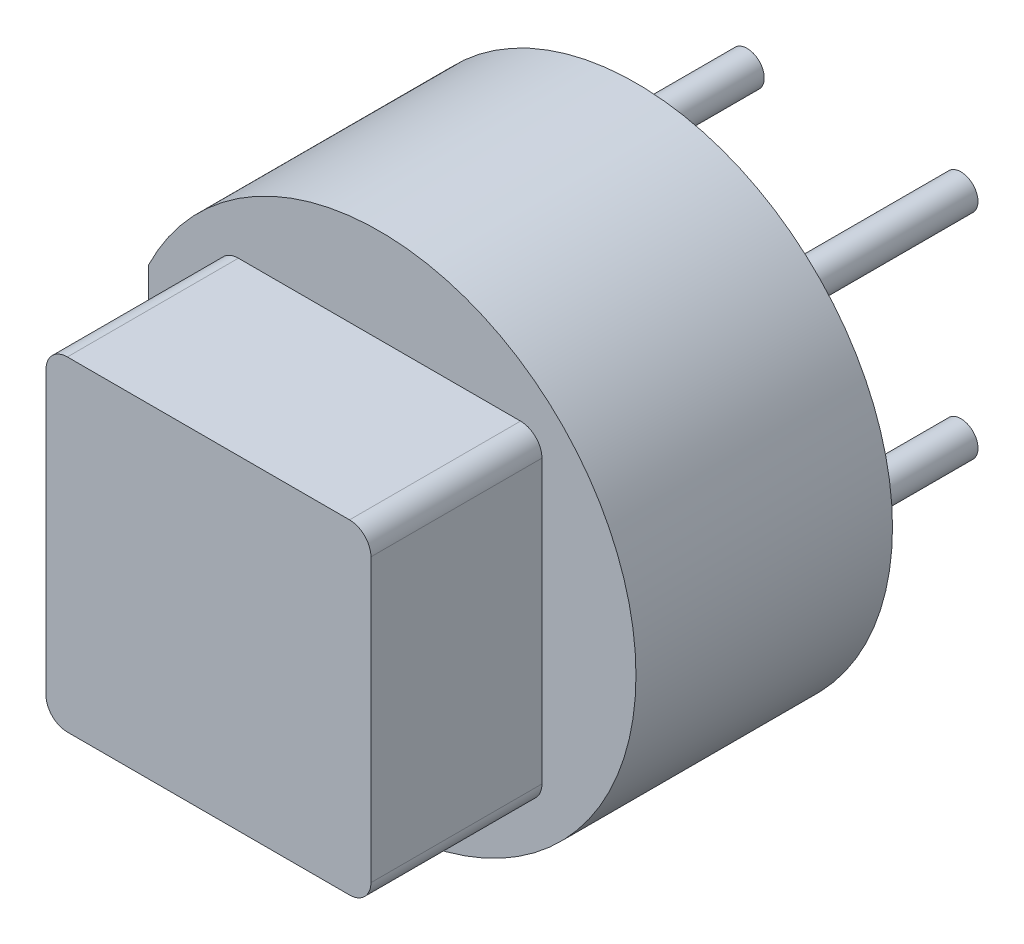
ISO-10303-21;
HEADER;
FILE_DESCRIPTION(('STEP AP214'),'2;1');
FILE_NAME('part.step','',(''),(''),'','','');
FILE_SCHEMA(('AUTOMOTIVE_DESIGN { 1 0 10303 214 1 1 1 1 }'));
ENDSEC;
DATA;
#1=APPLICATION_CONTEXT('core data for automotive mechanical design processes');
#2=APPLICATION_PROTOCOL_DEFINITION('international standard','automotive_design',2000,#1);
#3=PRODUCT_CONTEXT('',#1,'mechanical');
#4=PRODUCT('Part','Part','',(#3));
#5=PRODUCT_RELATED_PRODUCT_CATEGORY('part','',(#4));
#6=PRODUCT_DEFINITION_FORMATION('','',#4);
#7=PRODUCT_DEFINITION_CONTEXT('part definition',#1,'design');
#8=PRODUCT_DEFINITION('design','',#6,#7);
#9=PRODUCT_DEFINITION_SHAPE('','',#8);
#10=(LENGTH_UNIT() NAMED_UNIT(*) SI_UNIT(.MILLI.,.METRE.));
#11=(NAMED_UNIT(*) PLANE_ANGLE_UNIT() SI_UNIT($,.RADIAN.));
#12=(NAMED_UNIT(*) SI_UNIT($,.STERADIAN.) SOLID_ANGLE_UNIT());
#13=UNCERTAINTY_MEASURE_WITH_UNIT(LENGTH_MEASURE(1.E-05),#10,'distance_accuracy_value','');
#14=(GEOMETRIC_REPRESENTATION_CONTEXT(3) GLOBAL_UNCERTAINTY_ASSIGNED_CONTEXT((#13)) GLOBAL_UNIT_ASSIGNED_CONTEXT((#10,
#11,#12)) REPRESENTATION_CONTEXT('',''));
#15=CARTESIAN_POINT('',(0.,0.,0.));
#16=DIRECTION('',(0.,0.,1.));
#17=DIRECTION('',(1.,0.,0.));
#18=AXIS2_PLACEMENT_3D('',#15,#16,#17);
#19=CARTESIAN_POINT('',(0.,0.,6.));
#20=DIRECTION('',(0.,0.,-1.));
#21=DIRECTION('',(-1.,0.,0.));
#22=AXIS2_PLACEMENT_3D('',#19,#20,#21);
#23=PLANE('',#22);
#24=CARTESIAN_POINT('',(0.,0.,6.));
#25=DIRECTION('',(0.,0.,1.));
#26=DIRECTION('',(-1.,0.,0.));
#27=AXIS2_PLACEMENT_3D('',#24,#25,#26);
#28=CIRCLE('',#27,6.);
#29=CARTESIAN_POINT('',(-5.4,-2.6153393661244,6.));
#30=VERTEX_POINT('',#29);
#31=CARTESIAN_POINT('',(-5.4,2.6153393661244,6.));
#32=VERTEX_POINT('',#31);
#33=EDGE_CURVE('E199',#30,#32,#28,.T.);
#34=ORIENTED_EDGE('',*,*,#33,.T.);
#35=DIRECTION('',(0.,-1.,0.));
#36=VECTOR('',#35,1.);
#37=CARTESIAN_POINT('',(-5.4,2.6153393661244,6.));
#38=LINE('',#37,#36);
#39=EDGE_CURVE('E203',#32,#30,#38,.T.);
#40=ORIENTED_EDGE('',*,*,#39,.T.);
#41=EDGE_LOOP('',(#34,#40));
#42=FACE_BOUND('',#41,.T.);
#43=DIRECTION('',(0.,1.,0.));
#44=VECTOR('',#43,1.);
#45=CARTESIAN_POINT('',(3.8,-3.8,6.));
#46=LINE('',#45,#44);
#47=CARTESIAN_POINT('',(3.8,-3.3,6.));
#48=VERTEX_POINT('',#47);
#49=CARTESIAN_POINT('',(3.8,3.3,6.));
#50=VERTEX_POINT('',#49);
#51=EDGE_CURVE('E166',#48,#50,#46,.T.);
#52=ORIENTED_EDGE('',*,*,#51,.F.);
#53=CARTESIAN_POINT('',(3.3,-3.3,6.));
#54=DIRECTION('',(0.,0.,-1.));
#55=DIRECTION('',(-1.,0.,0.));
#56=AXIS2_PLACEMENT_3D('',#53,#54,#55);
#57=CIRCLE('',#56,0.5);
#58=CARTESIAN_POINT('',(3.3,-3.8,6.));
#59=VERTEX_POINT('',#58);
#60=EDGE_CURVE('E11',#48,#59,#57,.T.);
#61=ORIENTED_EDGE('',*,*,#60,.T.);
#62=DIRECTION('',(1.,0.,0.));
#63=VECTOR('',#62,1.);
#64=CARTESIAN_POINT('',(-3.8,-3.8,6.));
#65=LINE('',#64,#63);
#66=CARTESIAN_POINT('',(-3.3,-3.8,6.));
#67=VERTEX_POINT('',#66);
#68=EDGE_CURVE('E173',#67,#59,#65,.T.);
#69=ORIENTED_EDGE('',*,*,#68,.F.);
#70=CARTESIAN_POINT('',(-3.3,-3.3,6.));
#71=DIRECTION('',(0.,0.,-1.));
#72=DIRECTION('',(-1.,0.,0.));
#73=AXIS2_PLACEMENT_3D('',#70,#71,#72);
#74=CIRCLE('',#73,0.5);
#75=CARTESIAN_POINT('',(-3.8,-3.3,6.));
#76=VERTEX_POINT('',#75);
#77=EDGE_CURVE('E294',#67,#76,#74,.T.);
#78=ORIENTED_EDGE('',*,*,#77,.T.);
#79=DIRECTION('',(0.,-1.,0.));
#80=VECTOR('',#79,1.);
#81=CARTESIAN_POINT('',(-3.8,-3.8,6.));
#82=LINE('',#81,#80);
#83=CARTESIAN_POINT('',(-3.8,3.3,6.));
#84=VERTEX_POINT('',#83);
#85=EDGE_CURVE('E192',#84,#76,#82,.T.);
#86=ORIENTED_EDGE('',*,*,#85,.F.);
#87=CARTESIAN_POINT('',(-3.3,3.3,6.));
#88=DIRECTION('',(0.,0.,-1.));
#89=DIRECTION('',(-1.,0.,0.));
#90=AXIS2_PLACEMENT_3D('',#87,#88,#89);
#91=CIRCLE('',#90,0.5);
#92=CARTESIAN_POINT('',(-3.3,3.8,6.));
#93=VERTEX_POINT('',#92);
#94=EDGE_CURVE('E297',#84,#93,#91,.T.);
#95=ORIENTED_EDGE('',*,*,#94,.T.);
#96=DIRECTION('',(-1.,0.,0.));
#97=VECTOR('',#96,1.);
#98=CARTESIAN_POINT('',(-3.8,3.8,6.));
#99=LINE('',#98,#97);
#100=CARTESIAN_POINT('',(3.3,3.8,6.));
#101=VERTEX_POINT('',#100);
#102=EDGE_CURVE('E188',#101,#93,#99,.T.);
#103=ORIENTED_EDGE('',*,*,#102,.F.);
#104=CARTESIAN_POINT('',(3.3,3.3,6.));
#105=DIRECTION('',(0.,0.,-1.));
#106=DIRECTION('',(-1.,0.,0.));
#107=AXIS2_PLACEMENT_3D('',#104,#105,#106);
#108=CIRCLE('',#107,0.5);
#109=EDGE_CURVE('E53',#101,#50,#108,.T.);
#110=ORIENTED_EDGE('',*,*,#109,.T.);
#111=EDGE_LOOP('',(#52,#61,#69,#78,#86,#95,#103,#110));
#112=FACE_BOUND('',#111,.T.);
#113=ADVANCED_FACE('F44',(#42,#112),#23,.F.);
#114=CARTESIAN_POINT('',(0.,0.,6.));
#115=DIRECTION('',(0.,0.,-1.));
#116=DIRECTION('',(-1.,0.,0.));
#117=AXIS2_PLACEMENT_3D('',#114,#115,#116);
#118=CYLINDRICAL_SURFACE('',#117,6.);
#119=CARTESIAN_POINT('',(0.,0.,0.));
#120=DIRECTION('',(0.,0.,1.));
#121=DIRECTION('',(-1.,0.,0.));
#122=AXIS2_PLACEMENT_3D('',#119,#120,#121);
#123=CIRCLE('',#122,6.);
#124=CARTESIAN_POINT('',(-5.4,-2.6153393661244,0.));
#125=VERTEX_POINT('',#124);
#126=CARTESIAN_POINT('',(-5.4,2.6153393661244,0.));
#127=VERTEX_POINT('',#126);
#128=EDGE_CURVE('E185',#125,#127,#123,.T.);
#129=ORIENTED_EDGE('',*,*,#128,.T.);
#130=DIRECTION('',(0.,0.,-1.));
#131=VECTOR('',#130,1.);
#132=CARTESIAN_POINT('',(-5.4,2.6153393661244,6.));
#133=LINE('',#132,#131);
#134=EDGE_CURVE('E216',#32,#127,#133,.T.);
#135=ORIENTED_EDGE('',*,*,#134,.F.);
#136=ORIENTED_EDGE('',*,*,#33,.F.);
#137=DIRECTION('',(0.,0.,-1.));
#138=VECTOR('',#137,1.);
#139=CARTESIAN_POINT('',(-5.4,-2.6153393661244,6.));
#140=LINE('',#139,#138);
#141=EDGE_CURVE('E207',#30,#125,#140,.T.);
#142=ORIENTED_EDGE('',*,*,#141,.T.);
#143=EDGE_LOOP('',(#129,#135,#136,#142));
#144=FACE_BOUND('',#143,.T.);
#145=ADVANCED_FACE('F425',(#144),#118,.T.);
#146=CARTESIAN_POINT('',(-5.4,2.6153393661244,6.));
#147=DIRECTION('',(1.,0.,0.));
#148=DIRECTION('',(0.,0.,-1.));
#149=AXIS2_PLACEMENT_3D('',#146,#147,#148);
#150=PLANE('',#149);
#151=DIRECTION('',(0.,-1.,0.));
#152=VECTOR('',#151,1.);
#153=CARTESIAN_POINT('',(-5.4,2.6153393661244,0.));
#154=LINE('',#153,#152);
#155=EDGE_CURVE('E204',#127,#125,#154,.T.);
#156=ORIENTED_EDGE('',*,*,#155,.T.);
#157=ORIENTED_EDGE('',*,*,#141,.F.);
#158=ORIENTED_EDGE('',*,*,#39,.F.);
#159=ORIENTED_EDGE('',*,*,#134,.T.);
#160=EDGE_LOOP('',(#156,#157,#158,#159));
#161=FACE_BOUND('',#160,.T.);
#162=ADVANCED_FACE('F431',(#161),#150,.F.);
#163=CARTESIAN_POINT('',(0.,0.,0.));
#164=DIRECTION('',(0.,0.,-1.));
#165=DIRECTION('',(-1.,0.,0.));
#166=AXIS2_PLACEMENT_3D('',#163,#164,#165);
#167=PLANE('',#166);
#168=CARTESIAN_POINT('',(0.,0.,0.));
#169=DIRECTION('',(0.,0.,-1.));
#170=DIRECTION('',(1.,0.,0.));
#171=AXIS2_PLACEMENT_3D('',#168,#169,#170);
#172=CIRCLE('',#171,5.4);
#173=CARTESIAN_POINT('',(-4.8,2.4738633753706,0.));
#174=VERTEX_POINT('',#173);
#175=CARTESIAN_POINT('',(-4.8,-2.4738633753706,0.));
#176=VERTEX_POINT('',#175);
#177=EDGE_CURVE('E139',#174,#176,#172,.T.);
#178=ORIENTED_EDGE('',*,*,#177,.F.);
#179=DIRECTION('',(0.,1.,0.));
#180=VECTOR('',#179,1.);
#181=CARTESIAN_POINT('',(-4.8,-2.4738633753706,0.));
#182=LINE('',#181,#180);
#183=EDGE_CURVE('E151',#176,#174,#182,.T.);
#184=ORIENTED_EDGE('',*,*,#183,.F.);
#185=EDGE_LOOP('',(#178,#184));
#186=FACE_BOUND('',#185,.T.);
#187=ORIENTED_EDGE('',*,*,#128,.F.);
#188=ORIENTED_EDGE('',*,*,#155,.F.);
#189=EDGE_LOOP('',(#187,#188));
#190=FACE_BOUND('',#189,.T.);
#191=ADVANCED_FACE('F438',(#186,#190),#167,.T.);
#192=CARTESIAN_POINT('',(3.8,-3.8,10.));
#193=DIRECTION('',(-1.,0.,0.));
#194=DIRECTION('',(0.,0.,1.));
#195=AXIS2_PLACEMENT_3D('',#192,#193,#194);
#196=PLANE('',#195);
#197=ORIENTED_EDGE('',*,*,#51,.T.);
#198=DIRECTION('',(0.,0.,-1.));
#199=VECTOR('',#198,1.);
#200=CARTESIAN_POINT('',(3.8,3.3,10.));
#201=LINE('',#200,#199);
#202=CARTESIAN_POINT('',(3.8,3.3,10.));
#203=VERTEX_POINT('',#202);
#204=EDGE_CURVE('E291',#50,#203,#201,.F.);
#205=ORIENTED_EDGE('',*,*,#204,.T.);
#206=DIRECTION('',(0.,1.,0.));
#207=VECTOR('',#206,1.);
#208=CARTESIAN_POINT('',(3.8,-3.8,10.));
#209=LINE('',#208,#207);
#210=CARTESIAN_POINT('',(3.8,-3.3,10.));
#211=VERTEX_POINT('',#210);
#212=EDGE_CURVE('E168',#211,#203,#209,.T.);
#213=ORIENTED_EDGE('',*,*,#212,.F.);
#214=DIRECTION('',(0.,0.,-1.));
#215=VECTOR('',#214,1.);
#216=CARTESIAN_POINT('',(3.8,-3.3,10.));
#217=LINE('',#216,#215);
#218=EDGE_CURVE('E288',#211,#48,#217,.T.);
#219=ORIENTED_EDGE('',*,*,#218,.T.);
#220=EDGE_LOOP('',(#197,#205,#213,#219));
#221=FACE_BOUND('',#220,.T.);
#222=ADVANCED_FACE('F436',(#221),#196,.F.);
#223=CARTESIAN_POINT('',(-3.8,3.8,10.));
#224=DIRECTION('',(0.,-1.,0.));
#225=DIRECTION('',(0.,0.,-1.));
#226=AXIS2_PLACEMENT_3D('',#223,#224,#225);
#227=PLANE('',#226);
#228=ORIENTED_EDGE('',*,*,#102,.T.);
#229=DIRECTION('',(0.,0.,-1.));
#230=VECTOR('',#229,1.);
#231=CARTESIAN_POINT('',(-3.3,3.8,10.));
#232=LINE('',#231,#230);
#233=CARTESIAN_POINT('',(-3.3,3.8,10.));
#234=VERTEX_POINT('',#233);
#235=EDGE_CURVE('E285',#93,#234,#232,.F.);
#236=ORIENTED_EDGE('',*,*,#235,.T.);
#237=DIRECTION('',(-1.,0.,0.));
#238=VECTOR('',#237,1.);
#239=CARTESIAN_POINT('',(-3.8,3.8,10.));
#240=LINE('',#239,#238);
#241=CARTESIAN_POINT('',(3.3,3.8,10.));
#242=VERTEX_POINT('',#241);
#243=EDGE_CURVE('E172',#242,#234,#240,.T.);
#244=ORIENTED_EDGE('',*,*,#243,.F.);
#245=DIRECTION('',(0.,0.,-1.));
#246=VECTOR('',#245,1.);
#247=CARTESIAN_POINT('',(3.3,3.8,10.));
#248=LINE('',#247,#246);
#249=EDGE_CURVE('E281',#242,#101,#248,.T.);
#250=ORIENTED_EDGE('',*,*,#249,.T.);
#251=EDGE_LOOP('',(#228,#236,#244,#250));
#252=FACE_BOUND('',#251,.T.);
#253=ADVANCED_FACE('F468',(#252),#227,.F.);
#254=CARTESIAN_POINT('',(-3.8,-3.8,10.));
#255=DIRECTION('',(1.,0.,0.));
#256=DIRECTION('',(0.,0.,-1.));
#257=AXIS2_PLACEMENT_3D('',#254,#255,#256);
#258=PLANE('',#257);
#259=ORIENTED_EDGE('',*,*,#85,.T.);
#260=DIRECTION('',(0.,0.,-1.));
#261=VECTOR('',#260,1.);
#262=CARTESIAN_POINT('',(-3.8,-3.3,10.));
#263=LINE('',#262,#261);
#264=CARTESIAN_POINT('',(-3.8,-3.3,10.));
#265=VERTEX_POINT('',#264);
#266=EDGE_CURVE('E266',#76,#265,#263,.F.);
#267=ORIENTED_EDGE('',*,*,#266,.T.);
#268=DIRECTION('',(0.,-1.,0.));
#269=VECTOR('',#268,1.);
#270=CARTESIAN_POINT('',(-3.8,-3.8,10.));
#271=LINE('',#270,#269);
#272=CARTESIAN_POINT('',(-3.8,3.3,10.));
#273=VERTEX_POINT('',#272);
#274=EDGE_CURVE('E177',#273,#265,#271,.T.);
#275=ORIENTED_EDGE('',*,*,#274,.F.);
#276=DIRECTION('',(0.,0.,-1.));
#277=VECTOR('',#276,1.);
#278=CARTESIAN_POINT('',(-3.8,3.3,10.));
#279=LINE('',#278,#277);
#280=EDGE_CURVE('E262',#273,#84,#279,.T.);
#281=ORIENTED_EDGE('',*,*,#280,.T.);
#282=EDGE_LOOP('',(#259,#267,#275,#281));
#283=FACE_BOUND('',#282,.T.);
#284=ADVANCED_FACE('F474',(#283),#258,.F.);
#285=CARTESIAN_POINT('',(-3.8,-3.8,10.));
#286=DIRECTION('',(0.,1.,0.));
#287=DIRECTION('',(0.,0.,1.));
#288=AXIS2_PLACEMENT_3D('',#285,#286,#287);
#289=PLANE('',#288);
#290=DIRECTION('',(1.,0.,0.));
#291=VECTOR('',#290,1.);
#292=CARTESIAN_POINT('',(-3.8,-3.8,10.));
#293=LINE('',#292,#291);
#294=CARTESIAN_POINT('',(-3.3,-3.8,10.));
#295=VERTEX_POINT('',#294);
#296=CARTESIAN_POINT('',(3.3,-3.8,10.));
#297=VERTEX_POINT('',#296);
#298=EDGE_CURVE('E181',#295,#297,#293,.T.);
#299=ORIENTED_EDGE('',*,*,#298,.F.);
#300=DIRECTION('',(0.,0.,-1.));
#301=VECTOR('',#300,1.);
#302=CARTESIAN_POINT('',(-3.3,-3.8,10.));
#303=LINE('',#302,#301);
#304=EDGE_CURVE('E258',#295,#67,#303,.T.);
#305=ORIENTED_EDGE('',*,*,#304,.T.);
#306=ORIENTED_EDGE('',*,*,#68,.T.);
#307=DIRECTION('',(0.,0.,-1.));
#308=VECTOR('',#307,1.);
#309=CARTESIAN_POINT('',(3.3,-3.8,10.));
#310=LINE('',#309,#308);
#311=EDGE_CURVE('E255',#59,#297,#310,.F.);
#312=ORIENTED_EDGE('',*,*,#311,.T.);
#313=EDGE_LOOP('',(#299,#305,#306,#312));
#314=FACE_BOUND('',#313,.T.);
#315=ADVANCED_FACE('F481',(#314),#289,.F.);
#316=CARTESIAN_POINT('',(0.,0.,10.));
#317=DIRECTION('',(0.,0.,-1.));
#318=DIRECTION('',(-1.,0.,0.));
#319=AXIS2_PLACEMENT_3D('',#316,#317,#318);
#320=PLANE('',#319);
#321=ORIENTED_EDGE('',*,*,#274,.T.);
#322=CARTESIAN_POINT('',(-3.3,-3.3,10.));
#323=DIRECTION('',(0.,0.,-1.));
#324=DIRECTION('',(-1.,0.,0.));
#325=AXIS2_PLACEMENT_3D('',#322,#323,#324);
#326=CIRCLE('',#325,0.5);
#327=EDGE_CURVE('E278',#265,#295,#326,.F.);
#328=ORIENTED_EDGE('',*,*,#327,.T.);
#329=ORIENTED_EDGE('',*,*,#298,.T.);
#330=CARTESIAN_POINT('',(3.3,-3.3,10.));
#331=DIRECTION('',(0.,0.,-1.));
#332=DIRECTION('',(-1.,0.,0.));
#333=AXIS2_PLACEMENT_3D('',#330,#331,#332);
#334=CIRCLE('',#333,0.5);
#335=EDGE_CURVE('E269',#297,#211,#334,.F.);
#336=ORIENTED_EDGE('',*,*,#335,.T.);
#337=ORIENTED_EDGE('',*,*,#212,.T.);
#338=CARTESIAN_POINT('',(3.3,3.3,10.));
#339=DIRECTION('',(0.,0.,-1.));
#340=DIRECTION('',(-1.,0.,0.));
#341=AXIS2_PLACEMENT_3D('',#338,#339,#340);
#342=CIRCLE('',#341,0.5);
#343=EDGE_CURVE('E272',#203,#242,#342,.F.);
#344=ORIENTED_EDGE('',*,*,#343,.T.);
#345=ORIENTED_EDGE('',*,*,#243,.T.);
#346=CARTESIAN_POINT('',(-3.3,3.3,10.));
#347=DIRECTION('',(0.,0.,-1.));
#348=DIRECTION('',(-1.,0.,0.));
#349=AXIS2_PLACEMENT_3D('',#346,#347,#348);
#350=CIRCLE('',#349,0.5);
#351=EDGE_CURVE('E275',#234,#273,#350,.F.);
#352=ORIENTED_EDGE('',*,*,#351,.T.);
#353=EDGE_LOOP('',(#321,#328,#329,#336,#337,#344,#345,#352));
#354=FACE_BOUND('',#353,.T.);
#355=ADVANCED_FACE('F464',(#354),#320,.F.);
#356=CARTESIAN_POINT('',(0.,0.,0.1));
#357=DIRECTION('',(0.,0.,-1.));
#358=DIRECTION('',(-1.,0.,0.));
#359=AXIS2_PLACEMENT_3D('',#356,#357,#358);
#360=CYLINDRICAL_SURFACE('',#359,5.4);
#361=ORIENTED_EDGE('',*,*,#177,.T.);
#362=DIRECTION('',(0.,0.,-1.));
#363=VECTOR('',#362,1.);
#364=CARTESIAN_POINT('',(-4.8,-2.4738633753706,0.1));
#365=LINE('',#364,#363);
#366=CARTESIAN_POINT('',(-4.8,-2.4738633753706,0.1));
#367=VERTEX_POINT('',#366);
#368=EDGE_CURVE('E133',#367,#176,#365,.T.);
#369=ORIENTED_EDGE('',*,*,#368,.F.);
#370=CARTESIAN_POINT('',(0.,0.,0.1));
#371=DIRECTION('',(0.,0.,-1.));
#372=DIRECTION('',(1.,0.,0.));
#373=AXIS2_PLACEMENT_3D('',#370,#371,#372);
#374=CIRCLE('',#373,5.4);
#375=CARTESIAN_POINT('',(-4.8,2.4738633753706,0.1));
#376=VERTEX_POINT('',#375);
#377=EDGE_CURVE('E136',#376,#367,#374,.T.);
#378=ORIENTED_EDGE('',*,*,#377,.F.);
#379=DIRECTION('',(0.,0.,-1.));
#380=VECTOR('',#379,1.);
#381=CARTESIAN_POINT('',(-4.8,2.4738633753706,0.1));
#382=LINE('',#381,#380);
#383=EDGE_CURVE('E145',#376,#174,#382,.T.);
#384=ORIENTED_EDGE('',*,*,#383,.T.);
#385=EDGE_LOOP('',(#361,#369,#378,#384));
#386=FACE_BOUND('',#385,.T.);
#387=ADVANCED_FACE('F135',(#386),#360,.F.);
#388=CARTESIAN_POINT('',(-4.8,-2.4738633753706,0.1));
#389=DIRECTION('',(-1.,0.,0.));
#390=DIRECTION('',(0.,0.,1.));
#391=AXIS2_PLACEMENT_3D('',#388,#389,#390);
#392=PLANE('',#391);
#393=ORIENTED_EDGE('',*,*,#183,.T.);
#394=ORIENTED_EDGE('',*,*,#383,.F.);
#395=DIRECTION('',(0.,1.,0.));
#396=VECTOR('',#395,1.);
#397=CARTESIAN_POINT('',(-4.8,-2.4738633753706,0.1));
#398=LINE('',#397,#396);
#399=EDGE_CURVE('E146',#367,#376,#398,.T.);
#400=ORIENTED_EDGE('',*,*,#399,.F.);
#401=ORIENTED_EDGE('',*,*,#368,.T.);
#402=EDGE_LOOP('',(#393,#394,#400,#401));
#403=FACE_BOUND('',#402,.T.);
#404=ADVANCED_FACE('F153',(#403),#392,.F.);
#405=CARTESIAN_POINT('',(0.,0.,0.1));
#406=DIRECTION('',(0.,0.,1.));
#407=DIRECTION('',(1.,0.,0.));
#408=AXIS2_PLACEMENT_3D('',#405,#406,#407);
#409=PLANE('',#408);
#410=CARTESIAN_POINT('',(-2.5,2.5,0.1));
#411=DIRECTION('',(0.,0.,1.));
#412=DIRECTION('',(1.,0.,0.));
#413=AXIS2_PLACEMENT_3D('',#410,#411,#412);
#414=CIRCLE('',#413,0.4);
#415=CARTESIAN_POINT('',(-2.1,2.5,0.1));
#416=VERTEX_POINT('',#415);
#417=EDGE_CURVE('E251',#416,#416,#414,.F.);
#418=ORIENTED_EDGE('',*,*,#417,.F.);
#419=EDGE_LOOP('',(#418));
#420=FACE_BOUND('',#419,.T.);
#421=CARTESIAN_POINT('',(2.5,2.5,0.1));
#422=DIRECTION('',(0.,0.,1.));
#423=DIRECTION('',(1.,0.,0.));
#424=AXIS2_PLACEMENT_3D('',#421,#422,#423);
#425=CIRCLE('',#424,0.4);
#426=CARTESIAN_POINT('',(2.9,2.5,0.1));
#427=VERTEX_POINT('',#426);
#428=EDGE_CURVE('E248',#427,#427,#425,.F.);
#429=ORIENTED_EDGE('',*,*,#428,.F.);
#430=EDGE_LOOP('',(#429));
#431=FACE_BOUND('',#430,.T.);
#432=CARTESIAN_POINT('',(2.5,-2.5,0.1));
#433=DIRECTION('',(0.,0.,1.));
#434=DIRECTION('',(1.,0.,0.));
#435=AXIS2_PLACEMENT_3D('',#432,#433,#434);
#436=CIRCLE('',#435,0.4);
#437=CARTESIAN_POINT('',(2.9,-2.5,0.1));
#438=VERTEX_POINT('',#437);
#439=EDGE_CURVE('E244',#438,#438,#436,.F.);
#440=ORIENTED_EDGE('',*,*,#439,.F.);
#441=EDGE_LOOP('',(#440));
#442=FACE_BOUND('',#441,.T.);
#443=CARTESIAN_POINT('',(-2.5,-2.5,0.1));
#444=DIRECTION('',(0.,0.,1.));
#445=DIRECTION('',(1.,0.,0.));
#446=AXIS2_PLACEMENT_3D('',#443,#444,#445);
#447=CIRCLE('',#446,0.4);
#448=CARTESIAN_POINT('',(-2.1,-2.5,0.1));
#449=VERTEX_POINT('',#448);
#450=EDGE_CURVE('E240',#449,#449,#447,.F.);
#451=ORIENTED_EDGE('',*,*,#450,.F.);
#452=EDGE_LOOP('',(#451));
#453=FACE_BOUND('',#452,.T.);
#454=CARTESIAN_POINT('',(-4.,0.,0.1));
#455=DIRECTION('',(0.,0.,1.));
#456=DIRECTION('',(1.,0.,0.));
#457=AXIS2_PLACEMENT_3D('',#454,#455,#456);
#458=CIRCLE('',#457,0.6);
#459=CARTESIAN_POINT('',(-3.4,0.,0.1));
#460=VERTEX_POINT('',#459);
#461=EDGE_CURVE('E236',#460,#460,#458,.F.);
#462=ORIENTED_EDGE('',*,*,#461,.F.);
#463=EDGE_LOOP('',(#462));
#464=FACE_BOUND('',#463,.T.);
#465=CARTESIAN_POINT('',(0.,4.,0.1));
#466=DIRECTION('',(0.,0.,1.));
#467=DIRECTION('',(1.,0.,0.));
#468=AXIS2_PLACEMENT_3D('',#465,#466,#467);
#469=CIRCLE('',#468,0.6);
#470=CARTESIAN_POINT('',(0.6,4.,0.1));
#471=VERTEX_POINT('',#470);
#472=EDGE_CURVE('E232',#471,#471,#469,.F.);
#473=ORIENTED_EDGE('',*,*,#472,.F.);
#474=EDGE_LOOP('',(#473));
#475=FACE_BOUND('',#474,.T.);
#476=CARTESIAN_POINT('',(4.,0.,0.1));
#477=DIRECTION('',(0.,0.,1.));
#478=DIRECTION('',(1.,0.,0.));
#479=AXIS2_PLACEMENT_3D('',#476,#477,#478);
#480=CIRCLE('',#479,0.6);
#481=CARTESIAN_POINT('',(4.6,0.,0.1));
#482=VERTEX_POINT('',#481);
#483=EDGE_CURVE('E228',#482,#482,#480,.F.);
#484=ORIENTED_EDGE('',*,*,#483,.F.);
#485=EDGE_LOOP('',(#484));
#486=FACE_BOUND('',#485,.T.);
#487=CARTESIAN_POINT('',(0.,-4.,0.1));
#488=DIRECTION('',(0.,0.,1.));
#489=DIRECTION('',(1.,0.,0.));
#490=AXIS2_PLACEMENT_3D('',#487,#488,#489);
#491=CIRCLE('',#490,0.6);
#492=CARTESIAN_POINT('',(0.6,-4.,0.1));
#493=VERTEX_POINT('',#492);
#494=EDGE_CURVE('E224',#493,#493,#491,.F.);
#495=ORIENTED_EDGE('',*,*,#494,.F.);
#496=EDGE_LOOP('',(#495));
#497=FACE_BOUND('',#496,.T.);
#498=CARTESIAN_POINT('',(0.,0.,0.1));
#499=DIRECTION('',(0.,0.,1.));
#500=DIRECTION('',(1.,0.,0.));
#501=AXIS2_PLACEMENT_3D('',#498,#499,#500);
#502=CIRCLE('',#501,1.5);
#503=CARTESIAN_POINT('',(1.5,0.,0.1));
#504=VERTEX_POINT('',#503);
#505=EDGE_CURVE('E220',#504,#504,#502,.F.);
#506=ORIENTED_EDGE('',*,*,#505,.F.);
#507=EDGE_LOOP('',(#506));
#508=FACE_BOUND('',#507,.T.);
#509=ORIENTED_EDGE('',*,*,#377,.T.);
#510=ORIENTED_EDGE('',*,*,#399,.T.);
#511=EDGE_LOOP('',(#509,#510));
#512=FACE_BOUND('',#511,.T.);
#513=ADVANCED_FACE('F149',(#420,#431,#442,#453,#464,#475,#486,#497,#508,#512),#409,.F.);
#514=CARTESIAN_POINT('',(0.,0.,-1.1));
#515=DIRECTION('',(0.,0.,1.));
#516=DIRECTION('',(1.,0.,0.));
#517=AXIS2_PLACEMENT_3D('',#514,#515,#516);
#518=CYLINDRICAL_SURFACE('',#517,1.5);
#519=CARTESIAN_POINT('',(0.,0.,-1.1));
#520=DIRECTION('',(0.,0.,-1.));
#521=DIRECTION('',(-1.,0.,0.));
#522=AXIS2_PLACEMENT_3D('',#519,#520,#521);
#523=CIRCLE('',#522,1.5);
#524=CARTESIAN_POINT('',(-1.5,0.,-1.1));
#525=VERTEX_POINT('',#524);
#526=EDGE_CURVE('E162',#525,#525,#523,.T.);
#527=ORIENTED_EDGE('',*,*,#526,.F.);
#528=EDGE_LOOP('',(#527));
#529=FACE_BOUND('',#528,.T.);
#530=ORIENTED_EDGE('',*,*,#505,.T.);
#531=EDGE_LOOP('',(#530));
#532=FACE_BOUND('',#531,.T.);
#533=ADVANCED_FACE('F400',(#529,#532),#518,.T.);
#534=CARTESIAN_POINT('',(0.,0.,-1.1));
#535=DIRECTION('',(0.,0.,-1.));
#536=DIRECTION('',(-1.,0.,0.));
#537=AXIS2_PLACEMENT_3D('',#534,#535,#536);
#538=PLANE('',#537);
#539=ORIENTED_EDGE('',*,*,#526,.T.);
#540=EDGE_LOOP('',(#539));
#541=FACE_BOUND('',#540,.T.);
#542=ADVANCED_FACE('F414',(#541),#538,.T.);
#543=CARTESIAN_POINT('',(0.,-4.,-1.1));
#544=DIRECTION('',(0.,0.,1.));
#545=DIRECTION('',(1.,0.,0.));
#546=AXIS2_PLACEMENT_3D('',#543,#544,#545);
#547=CYLINDRICAL_SURFACE('',#546,0.6);
#548=CARTESIAN_POINT('',(0.,-4.,-1.1));
#549=DIRECTION('',(0.,0.,-1.));
#550=DIRECTION('',(-1.,0.,0.));
#551=AXIS2_PLACEMENT_3D('',#548,#549,#550);
#552=CIRCLE('',#551,0.6);
#553=CARTESIAN_POINT('',(-0.6,-4.,-1.1));
#554=VERTEX_POINT('',#553);
#555=EDGE_CURVE('E369',#554,#554,#552,.T.);
#556=ORIENTED_EDGE('',*,*,#555,.F.);
#557=EDGE_LOOP('',(#556));
#558=FACE_BOUND('',#557,.T.);
#559=ORIENTED_EDGE('',*,*,#494,.T.);
#560=EDGE_LOOP('',(#559));
#561=FACE_BOUND('',#560,.T.);
#562=ADVANCED_FACE('F420',(#558,#561),#547,.T.);
#563=CARTESIAN_POINT('',(0.,-4.,-1.1));
#564=DIRECTION('',(0.,0.,-1.));
#565=DIRECTION('',(-1.,0.,0.));
#566=AXIS2_PLACEMENT_3D('',#563,#564,#565);
#567=PLANE('',#566);
#568=ORIENTED_EDGE('',*,*,#555,.T.);
#569=EDGE_LOOP('',(#568));
#570=FACE_BOUND('',#569,.T.);
#571=ADVANCED_FACE('F525',(#570),#567,.T.);
#572=CARTESIAN_POINT('',(4.,0.,-1.1));
#573=DIRECTION('',(0.,0.,1.));
#574=DIRECTION('',(1.,0.,0.));
#575=AXIS2_PLACEMENT_3D('',#572,#573,#574);
#576=CYLINDRICAL_SURFACE('',#575,0.6);
#577=CARTESIAN_POINT('',(4.,0.,-1.1));
#578=DIRECTION('',(0.,0.,-1.));
#579=DIRECTION('',(-1.,0.,0.));
#580=AXIS2_PLACEMENT_3D('',#577,#578,#579);
#581=CIRCLE('',#580,0.6);
#582=CARTESIAN_POINT('',(3.4,0.,-1.1));
#583=VERTEX_POINT('',#582);
#584=EDGE_CURVE('E345',#583,#583,#581,.T.);
#585=ORIENTED_EDGE('',*,*,#584,.F.);
#586=EDGE_LOOP('',(#585));
#587=FACE_BOUND('',#586,.T.);
#588=ORIENTED_EDGE('',*,*,#483,.T.);
#589=EDGE_LOOP('',(#588));
#590=FACE_BOUND('',#589,.T.);
#591=ADVANCED_FACE('F535',(#587,#590),#576,.T.);
#592=CARTESIAN_POINT('',(4.,0.,-1.1));
#593=DIRECTION('',(0.,0.,-1.));
#594=DIRECTION('',(-1.,0.,0.));
#595=AXIS2_PLACEMENT_3D('',#592,#593,#594);
#596=PLANE('',#595);
#597=ORIENTED_EDGE('',*,*,#584,.T.);
#598=EDGE_LOOP('',(#597));
#599=FACE_BOUND('',#598,.T.);
#600=ADVANCED_FACE('F545',(#599),#596,.T.);
#601=CARTESIAN_POINT('',(0.,4.,-1.1));
#602=DIRECTION('',(0.,0.,1.));
#603=DIRECTION('',(1.,0.,0.));
#604=AXIS2_PLACEMENT_3D('',#601,#602,#603);
#605=CYLINDRICAL_SURFACE('',#604,0.6);
#606=CARTESIAN_POINT('',(0.,4.,-1.1));
#607=DIRECTION('',(0.,0.,-1.));
#608=DIRECTION('',(-1.,0.,0.));
#609=AXIS2_PLACEMENT_3D('',#606,#607,#608);
#610=CIRCLE('',#609,0.6);
#611=CARTESIAN_POINT('',(-0.6,4.,-1.1));
#612=VERTEX_POINT('',#611);
#613=EDGE_CURVE('E342',#612,#612,#610,.T.);
#614=ORIENTED_EDGE('',*,*,#613,.F.);
#615=EDGE_LOOP('',(#614));
#616=FACE_BOUND('',#615,.T.);
#617=ORIENTED_EDGE('',*,*,#472,.T.);
#618=EDGE_LOOP('',(#617));
#619=FACE_BOUND('',#618,.T.);
#620=ADVANCED_FACE('F553',(#616,#619),#605,.T.);
#621=CARTESIAN_POINT('',(0.,4.,-1.1));
#622=DIRECTION('',(0.,0.,-1.));
#623=DIRECTION('',(-1.,0.,0.));
#624=AXIS2_PLACEMENT_3D('',#621,#622,#623);
#625=PLANE('',#624);
#626=ORIENTED_EDGE('',*,*,#613,.T.);
#627=EDGE_LOOP('',(#626));
#628=FACE_BOUND('',#627,.T.);
#629=ADVANCED_FACE('F561',(#628),#625,.T.);
#630=CARTESIAN_POINT('',(-4.,0.,-1.1));
#631=DIRECTION('',(0.,0.,1.));
#632=DIRECTION('',(1.,0.,0.));
#633=AXIS2_PLACEMENT_3D('',#630,#631,#632);
#634=CYLINDRICAL_SURFACE('',#633,0.6);
#635=CARTESIAN_POINT('',(-4.,0.,-1.1));
#636=DIRECTION('',(0.,0.,-1.));
#637=DIRECTION('',(-1.,0.,0.));
#638=AXIS2_PLACEMENT_3D('',#635,#636,#637);
#639=CIRCLE('',#638,0.6);
#640=CARTESIAN_POINT('',(-4.6,0.,-1.1));
#641=VERTEX_POINT('',#640);
#642=EDGE_CURVE('E346',#641,#641,#639,.T.);
#643=ORIENTED_EDGE('',*,*,#642,.F.);
#644=EDGE_LOOP('',(#643));
#645=FACE_BOUND('',#644,.T.);
#646=ORIENTED_EDGE('',*,*,#461,.T.);
#647=EDGE_LOOP('',(#646));
#648=FACE_BOUND('',#647,.T.);
#649=ADVANCED_FACE('F570',(#645,#648),#634,.T.);
#650=CARTESIAN_POINT('',(-4.,0.,-1.1));
#651=DIRECTION('',(0.,0.,-1.));
#652=DIRECTION('',(-1.,0.,0.));
#653=AXIS2_PLACEMENT_3D('',#650,#651,#652);
#654=PLANE('',#653);
#655=ORIENTED_EDGE('',*,*,#642,.T.);
#656=EDGE_LOOP('',(#655));
#657=FACE_BOUND('',#656,.T.);
#658=ADVANCED_FACE('F394',(#657),#654,.T.);
#659=CARTESIAN_POINT('',(-2.5,-2.5,-5.1));
#660=DIRECTION('',(0.,0.,1.));
#661=DIRECTION('',(1.,0.,0.));
#662=AXIS2_PLACEMENT_3D('',#659,#660,#661);
#663=CYLINDRICAL_SURFACE('',#662,0.4);
#664=CARTESIAN_POINT('',(-2.5,-2.5,-5.1));
#665=DIRECTION('',(0.,0.,-1.));
#666=DIRECTION('',(-1.,0.,0.));
#667=AXIS2_PLACEMENT_3D('',#664,#665,#666);
#668=CIRCLE('',#667,0.4);
#669=CARTESIAN_POINT('',(-2.9,-2.5,-5.1));
#670=VERTEX_POINT('',#669);
#671=EDGE_CURVE('E316',#670,#670,#668,.T.);
#672=ORIENTED_EDGE('',*,*,#671,.F.);
#673=EDGE_LOOP('',(#672));
#674=FACE_BOUND('',#673,.T.);
#675=ORIENTED_EDGE('',*,*,#450,.T.);
#676=EDGE_LOOP('',(#675));
#677=FACE_BOUND('',#676,.T.);
#678=ADVANCED_FACE('F391',(#674,#677),#663,.T.);
#679=CARTESIAN_POINT('',(-2.5,-2.5,-5.1));
#680=DIRECTION('',(0.,0.,-1.));
#681=DIRECTION('',(-1.,0.,0.));
#682=AXIS2_PLACEMENT_3D('',#679,#680,#681);
#683=PLANE('',#682);
#684=ORIENTED_EDGE('',*,*,#671,.T.);
#685=EDGE_LOOP('',(#684));
#686=FACE_BOUND('',#685,.T.);
#687=ADVANCED_FACE('F389',(#686),#683,.T.);
#688=CARTESIAN_POINT('',(2.5,-2.5,-5.1));
#689=DIRECTION('',(0.,0.,1.));
#690=DIRECTION('',(1.,0.,0.));
#691=AXIS2_PLACEMENT_3D('',#688,#689,#690);
#692=CYLINDRICAL_SURFACE('',#691,0.4);
#693=CARTESIAN_POINT('',(2.5,-2.5,-5.1));
#694=DIRECTION('',(0.,0.,-1.));
#695=DIRECTION('',(-1.,0.,0.));
#696=AXIS2_PLACEMENT_3D('',#693,#694,#695);
#697=CIRCLE('',#696,0.4);
#698=CARTESIAN_POINT('',(2.1,-2.5,-5.1));
#699=VERTEX_POINT('',#698);
#700=EDGE_CURVE('E313',#699,#699,#697,.T.);
#701=ORIENTED_EDGE('',*,*,#700,.F.);
#702=EDGE_LOOP('',(#701));
#703=FACE_BOUND('',#702,.T.);
#704=ORIENTED_EDGE('',*,*,#439,.T.);
#705=EDGE_LOOP('',(#704));
#706=FACE_BOUND('',#705,.T.);
#707=ADVANCED_FACE('F599',(#703,#706),#692,.T.);
#708=CARTESIAN_POINT('',(2.5,-2.5,-5.1));
#709=DIRECTION('',(0.,0.,-1.));
#710=DIRECTION('',(-1.,0.,0.));
#711=AXIS2_PLACEMENT_3D('',#708,#709,#710);
#712=PLANE('',#711);
#713=ORIENTED_EDGE('',*,*,#700,.T.);
#714=EDGE_LOOP('',(#713));
#715=FACE_BOUND('',#714,.T.);
#716=ADVANCED_FACE('F607',(#715),#712,.T.);
#717=CARTESIAN_POINT('',(2.5,2.5,-5.1));
#718=DIRECTION('',(0.,0.,1.));
#719=DIRECTION('',(1.,0.,0.));
#720=AXIS2_PLACEMENT_3D('',#717,#718,#719);
#721=CYLINDRICAL_SURFACE('',#720,0.4);
#722=CARTESIAN_POINT('',(2.5,2.5,-5.1));
#723=DIRECTION('',(0.,0.,-1.));
#724=DIRECTION('',(-1.,0.,0.));
#725=AXIS2_PLACEMENT_3D('',#722,#723,#724);
#726=CIRCLE('',#725,0.4);
#727=CARTESIAN_POINT('',(2.1,2.5,-5.1));
#728=VERTEX_POINT('',#727);
#729=EDGE_CURVE('E317',#728,#728,#726,.T.);
#730=ORIENTED_EDGE('',*,*,#729,.F.);
#731=EDGE_LOOP('',(#730));
#732=FACE_BOUND('',#731,.T.);
#733=ORIENTED_EDGE('',*,*,#428,.T.);
#734=EDGE_LOOP('',(#733));
#735=FACE_BOUND('',#734,.T.);
#736=ADVANCED_FACE('F616',(#732,#735),#721,.T.);
#737=CARTESIAN_POINT('',(2.5,2.5,-5.1));
#738=DIRECTION('',(0.,0.,-1.));
#739=DIRECTION('',(-1.,0.,0.));
#740=AXIS2_PLACEMENT_3D('',#737,#738,#739);
#741=PLANE('',#740);
#742=ORIENTED_EDGE('',*,*,#729,.T.);
#743=EDGE_LOOP('',(#742));
#744=FACE_BOUND('',#743,.T.);
#745=ADVANCED_FACE('F625',(#744),#741,.T.);
#746=CARTESIAN_POINT('',(-2.5,2.5,-5.1));
#747=DIRECTION('',(0.,0.,1.));
#748=DIRECTION('',(1.,0.,0.));
#749=AXIS2_PLACEMENT_3D('',#746,#747,#748);
#750=CYLINDRICAL_SURFACE('',#749,0.4);
#751=CARTESIAN_POINT('',(-2.5,2.5,-5.1));
#752=DIRECTION('',(0.,0.,-1.));
#753=DIRECTION('',(-1.,0.,0.));
#754=AXIS2_PLACEMENT_3D('',#751,#752,#753);
#755=CIRCLE('',#754,0.4);
#756=CARTESIAN_POINT('',(-2.9,2.5,-5.1));
#757=VERTEX_POINT('',#756);
#758=EDGE_CURVE('E330',#757,#757,#755,.T.);
#759=ORIENTED_EDGE('',*,*,#758,.F.);
#760=EDGE_LOOP('',(#759));
#761=FACE_BOUND('',#760,.T.);
#762=ORIENTED_EDGE('',*,*,#417,.T.);
#763=EDGE_LOOP('',(#762));
#764=FACE_BOUND('',#763,.T.);
#765=ADVANCED_FACE('F634',(#761,#764),#750,.T.);
#766=CARTESIAN_POINT('',(-2.5,2.5,-5.1));
#767=DIRECTION('',(0.,0.,-1.));
#768=DIRECTION('',(-1.,0.,0.));
#769=AXIS2_PLACEMENT_3D('',#766,#767,#768);
#770=PLANE('',#769);
#771=ORIENTED_EDGE('',*,*,#758,.T.);
#772=EDGE_LOOP('',(#771));
#773=FACE_BOUND('',#772,.T.);
#774=ADVANCED_FACE('F449',(#773),#770,.T.);
#775=CARTESIAN_POINT('',(-3.3,-3.3,10.));
#776=DIRECTION('',(0.,0.,-1.));
#777=DIRECTION('',(-1.,0.,0.));
#778=AXIS2_PLACEMENT_3D('',#775,#776,#777);
#779=CYLINDRICAL_SURFACE('',#778,0.5);
#780=ORIENTED_EDGE('',*,*,#327,.F.);
#781=ORIENTED_EDGE('',*,*,#266,.F.);
#782=ORIENTED_EDGE('',*,*,#77,.F.);
#783=ORIENTED_EDGE('',*,*,#304,.F.);
#784=EDGE_LOOP('',(#780,#781,#782,#783));
#785=FACE_BOUND('',#784,.T.);
#786=ADVANCED_FACE('F445',(#785),#779,.T.);
#787=CARTESIAN_POINT('',(-3.3,3.3,10.));
#788=DIRECTION('',(0.,0.,-1.));
#789=DIRECTION('',(-1.,0.,0.));
#790=AXIS2_PLACEMENT_3D('',#787,#788,#789);
#791=CYLINDRICAL_SURFACE('',#790,0.5);
#792=ORIENTED_EDGE('',*,*,#351,.F.);
#793=ORIENTED_EDGE('',*,*,#235,.F.);
#794=ORIENTED_EDGE('',*,*,#94,.F.);
#795=ORIENTED_EDGE('',*,*,#280,.F.);
#796=EDGE_LOOP('',(#792,#793,#794,#795));
#797=FACE_BOUND('',#796,.T.);
#798=ADVANCED_FACE('F448',(#797),#791,.T.);
#799=CARTESIAN_POINT('',(3.3,3.3,10.));
#800=DIRECTION('',(0.,0.,-1.));
#801=DIRECTION('',(-1.,0.,0.));
#802=AXIS2_PLACEMENT_3D('',#799,#800,#801);
#803=CYLINDRICAL_SURFACE('',#802,0.5);
#804=ORIENTED_EDGE('',*,*,#343,.F.);
#805=ORIENTED_EDGE('',*,*,#204,.F.);
#806=ORIENTED_EDGE('',*,*,#109,.F.);
#807=ORIENTED_EDGE('',*,*,#249,.F.);
#808=EDGE_LOOP('',(#804,#805,#806,#807));
#809=FACE_BOUND('',#808,.T.);
#810=ADVANCED_FACE('F452',(#809),#803,.T.);
#811=CARTESIAN_POINT('',(3.3,-3.3,10.));
#812=DIRECTION('',(0.,0.,-1.));
#813=DIRECTION('',(-1.,0.,0.));
#814=AXIS2_PLACEMENT_3D('',#811,#812,#813);
#815=CYLINDRICAL_SURFACE('',#814,0.5);
#816=ORIENTED_EDGE('',*,*,#335,.F.);
#817=ORIENTED_EDGE('',*,*,#311,.F.);
#818=ORIENTED_EDGE('',*,*,#60,.F.);
#819=ORIENTED_EDGE('',*,*,#218,.F.);
#820=EDGE_LOOP('',(#816,#817,#818,#819));
#821=FACE_BOUND('',#820,.T.);
#822=ADVANCED_FACE('F46',(#821),#815,.T.);
#823=CLOSED_SHELL('',(#113,#145,#162,#191,#222,#253,#284,#315,#355,#387,#404,#513,#533,#542,
#562,#571,#591,#600,#620,#629,#649,#658,#678,#687,#707,#716,#736,#745,#765,#774,#786,#798,#810,#822));
#824=MANIFOLD_SOLID_BREP('B2',#823);
#825=ADVANCED_BREP_SHAPE_REPRESENTATION('',(#18,#824),#14);
#826=SHAPE_DEFINITION_REPRESENTATION(#9,#825);
ENDSEC;
END-ISO-10303-21;
